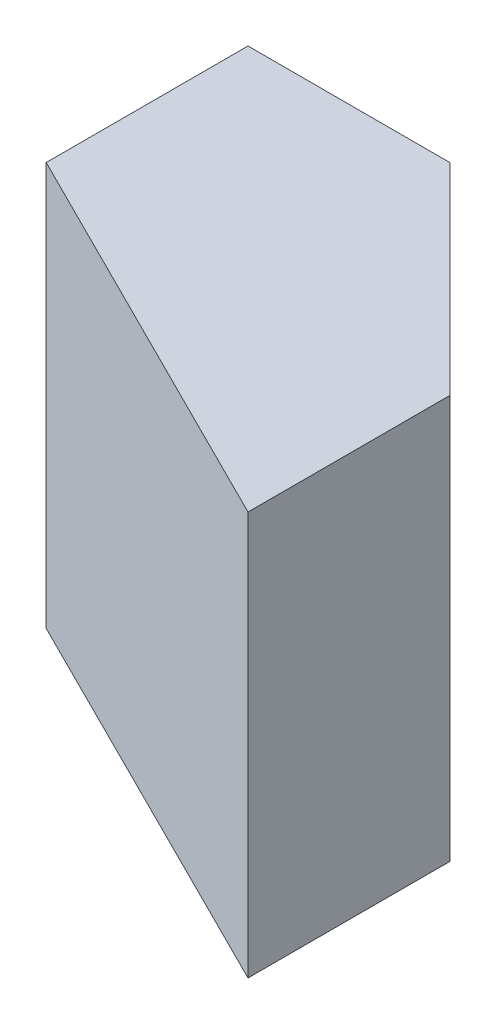
ISO-10303-21;
HEADER;
FILE_DESCRIPTION(('STEP AP214'),'2;1');
FILE_NAME('part.step','',(''),(''),'','','');
FILE_SCHEMA(('AUTOMOTIVE_DESIGN { 1 0 10303 214 1 1 1 1 }'));
ENDSEC;
DATA;
#1=APPLICATION_CONTEXT('core data for automotive mechanical design processes');
#2=APPLICATION_PROTOCOL_DEFINITION('international standard','automotive_design',2000,#1);
#3=PRODUCT_CONTEXT('',#1,'mechanical');
#4=PRODUCT('Part','Part','',(#3));
#5=PRODUCT_RELATED_PRODUCT_CATEGORY('part','',(#4));
#6=PRODUCT_DEFINITION_FORMATION('','',#4);
#7=PRODUCT_DEFINITION_CONTEXT('part definition',#1,'design');
#8=PRODUCT_DEFINITION('design','',#6,#7);
#9=PRODUCT_DEFINITION_SHAPE('','',#8);
#10=(LENGTH_UNIT() NAMED_UNIT(*) SI_UNIT(.MILLI.,.METRE.));
#11=(NAMED_UNIT(*) PLANE_ANGLE_UNIT() SI_UNIT($,.RADIAN.));
#12=(NAMED_UNIT(*) SI_UNIT($,.STERADIAN.) SOLID_ANGLE_UNIT());
#13=UNCERTAINTY_MEASURE_WITH_UNIT(LENGTH_MEASURE(1.E-05),#10,'distance_accuracy_value','');
#14=(GEOMETRIC_REPRESENTATION_CONTEXT(3) GLOBAL_UNCERTAINTY_ASSIGNED_CONTEXT((#13)) GLOBAL_UNIT_ASSIGNED_CONTEXT((#10,
#11,#12)) REPRESENTATION_CONTEXT('',''));
#15=CARTESIAN_POINT('',(0.,0.,0.));
#16=DIRECTION('',(0.,0.,1.));
#17=DIRECTION('',(1.,0.,0.));
#18=AXIS2_PLACEMENT_3D('',#15,#16,#17);
#19=CARTESIAN_POINT('',(0.,0.,20.));
#20=DIRECTION('',(1.,0.,0.));
#21=DIRECTION('',(0.,0.,-1.));
#22=AXIS2_PLACEMENT_3D('',#19,#20,#21);
#23=PLANE('',#22);
#24=DIRECTION('',(0.,0.,-1.));
#25=VECTOR('',#24,1.);
#26=CARTESIAN_POINT('',(0.,0.,20.));
#27=LINE('',#26,#25);
#28=CARTESIAN_POINT('',(0.,0.,10.));
#29=VERTEX_POINT('',#28);
#30=CARTESIAN_POINT('',(0.,0.,0.));
#31=VERTEX_POINT('',#30);
#32=EDGE_CURVE('E11',#29,#31,#27,.T.);
#33=ORIENTED_EDGE('',*,*,#32,.F.);
#34=DIRECTION('',(0.,1.,0.));
#35=VECTOR('',#34,1.);
#36=CARTESIAN_POINT('',(0.,0.,10.));
#37=LINE('',#36,#35);
#38=CARTESIAN_POINT('',(0.,20.,10.));
#39=VERTEX_POINT('',#38);
#40=EDGE_CURVE('E83',#29,#39,#37,.T.);
#41=ORIENTED_EDGE('',*,*,#40,.T.);
#42=DIRECTION('',(0.,0.,-1.));
#43=VECTOR('',#42,1.);
#44=CARTESIAN_POINT('',(0.,20.,20.));
#45=LINE('',#44,#43);
#46=CARTESIAN_POINT('',(0.,20.,0.));
#47=VERTEX_POINT('',#46);
#48=EDGE_CURVE('E97',#39,#47,#45,.T.);
#49=ORIENTED_EDGE('',*,*,#48,.T.);
#50=DIRECTION('',(0.,-1.,0.));
#51=VECTOR('',#50,1.);
#52=CARTESIAN_POINT('',(0.,0.,0.));
#53=LINE('',#52,#51);
#54=EDGE_CURVE('E120',#47,#31,#53,.T.);
#55=ORIENTED_EDGE('',*,*,#54,.T.);
#56=EDGE_LOOP('',(#33,#41,#49,#55));
#57=FACE_BOUND('',#56,.T.);
#58=ADVANCED_FACE('F33',(#57),#23,.F.);
#59=CARTESIAN_POINT('',(0.,0.,20.));
#60=DIRECTION('',(0.,1.,0.));
#61=DIRECTION('',(0.,0.,1.));
#62=AXIS2_PLACEMENT_3D('',#59,#60,#61);
#63=PLANE('',#62);
#64=DIRECTION('',(0.,0.,-1.));
#65=VECTOR('',#64,1.);
#66=CARTESIAN_POINT('',(20.,0.,20.));
#67=LINE('',#66,#65);
#68=CARTESIAN_POINT('',(20.,0.,20.));
#69=VERTEX_POINT('',#68);
#70=CARTESIAN_POINT('',(20.,0.,10.));
#71=VERTEX_POINT('',#70);
#72=EDGE_CURVE('E40',#69,#71,#67,.T.);
#73=ORIENTED_EDGE('',*,*,#72,.F.);
#74=DIRECTION('',(-0.894427190999916,0.,-0.447213595499958));
#75=VECTOR('',#74,1.);
#76=CARTESIAN_POINT('',(0.,0.,10.));
#77=LINE('',#76,#75);
#78=EDGE_CURVE('E56',#69,#29,#77,.T.);
#79=ORIENTED_EDGE('',*,*,#78,.T.);
#80=ORIENTED_EDGE('',*,*,#32,.T.);
#81=DIRECTION('',(1.,0.,0.));
#82=VECTOR('',#81,1.);
#83=CARTESIAN_POINT('',(0.,0.,0.));
#84=LINE('',#83,#82);
#85=CARTESIAN_POINT('',(10.,0.,0.));
#86=VERTEX_POINT('',#85);
#87=EDGE_CURVE('E115',#31,#86,#84,.T.);
#88=ORIENTED_EDGE('',*,*,#87,.T.);
#89=DIRECTION('',(0.707106781186548,0.,0.707106781186548));
#90=VECTOR('',#89,1.);
#91=CARTESIAN_POINT('',(10.,0.,0.));
#92=LINE('',#91,#90);
#93=EDGE_CURVE('E47',#86,#71,#92,.T.);
#94=ORIENTED_EDGE('',*,*,#93,.T.);
#95=EDGE_LOOP('',(#73,#79,#80,#88,#94));
#96=FACE_BOUND('',#95,.T.);
#97=ADVANCED_FACE('F114',(#96),#63,.F.);
#98=CARTESIAN_POINT('',(20.,0.,20.));
#99=DIRECTION('',(-1.,0.,0.));
#100=DIRECTION('',(0.,0.,1.));
#101=AXIS2_PLACEMENT_3D('',#98,#99,#100);
#102=PLANE('',#101);
#103=ORIENTED_EDGE('',*,*,#72,.T.);
#104=DIRECTION('',(0.,1.,0.));
#105=VECTOR('',#104,1.);
#106=CARTESIAN_POINT('',(20.,0.,10.));
#107=LINE('',#106,#105);
#108=CARTESIAN_POINT('',(20.,20.,10.));
#109=VERTEX_POINT('',#108);
#110=EDGE_CURVE('E72',#71,#109,#107,.T.);
#111=ORIENTED_EDGE('',*,*,#110,.T.);
#112=DIRECTION('',(0.,0.,-1.));
#113=VECTOR('',#112,1.);
#114=CARTESIAN_POINT('',(20.,20.,20.));
#115=LINE('',#114,#113);
#116=CARTESIAN_POINT('',(20.,20.,20.));
#117=VERTEX_POINT('',#116);
#118=EDGE_CURVE('E105',#117,#109,#115,.T.);
#119=ORIENTED_EDGE('',*,*,#118,.F.);
#120=DIRECTION('',(0.,1.,0.));
#121=VECTOR('',#120,1.);
#122=CARTESIAN_POINT('',(20.,0.,20.));
#123=LINE('',#122,#121);
#124=EDGE_CURVE('E89',#69,#117,#123,.T.);
#125=ORIENTED_EDGE('',*,*,#124,.F.);
#126=EDGE_LOOP('',(#103,#111,#119,#125));
#127=FACE_BOUND('',#126,.T.);
#128=ADVANCED_FACE('F113',(#127),#102,.F.);
#129=CARTESIAN_POINT('',(0.,20.,20.));
#130=DIRECTION('',(0.,-1.,0.));
#131=DIRECTION('',(0.,0.,-1.));
#132=AXIS2_PLACEMENT_3D('',#129,#130,#131);
#133=PLANE('',#132);
#134=ORIENTED_EDGE('',*,*,#48,.F.);
#135=DIRECTION('',(-0.894427190999916,0.,-0.447213595499958));
#136=VECTOR('',#135,1.);
#137=CARTESIAN_POINT('',(0.,20.,10.));
#138=LINE('',#137,#136);
#139=EDGE_CURVE('E86',#117,#39,#138,.T.);
#140=ORIENTED_EDGE('',*,*,#139,.F.);
#141=ORIENTED_EDGE('',*,*,#118,.T.);
#142=DIRECTION('',(0.707106781186548,0.,0.707106781186548));
#143=VECTOR('',#142,1.);
#144=CARTESIAN_POINT('',(10.,20.,0.));
#145=LINE('',#144,#143);
#146=CARTESIAN_POINT('',(10.,20.,0.));
#147=VERTEX_POINT('',#146);
#148=EDGE_CURVE('E99',#147,#109,#145,.T.);
#149=ORIENTED_EDGE('',*,*,#148,.F.);
#150=DIRECTION('',(-1.,0.,0.));
#151=VECTOR('',#150,1.);
#152=CARTESIAN_POINT('',(0.,20.,0.));
#153=LINE('',#152,#151);
#154=EDGE_CURVE('E103',#147,#47,#153,.T.);
#155=ORIENTED_EDGE('',*,*,#154,.T.);
#156=EDGE_LOOP('',(#134,#140,#141,#149,#155));
#157=FACE_BOUND('',#156,.T.);
#158=ADVANCED_FACE('F101',(#157),#133,.F.);
#159=CARTESIAN_POINT('',(0.,0.,0.));
#160=DIRECTION('',(0.,0.,-1.));
#161=DIRECTION('',(-1.,0.,0.));
#162=AXIS2_PLACEMENT_3D('',#159,#160,#161);
#163=PLANE('',#162);
#164=DIRECTION('',(0.,1.,0.));
#165=VECTOR('',#164,1.);
#166=CARTESIAN_POINT('',(10.,0.,0.));
#167=LINE('',#166,#165);
#168=EDGE_CURVE('E78',#86,#147,#167,.T.);
#169=ORIENTED_EDGE('',*,*,#168,.F.);
#170=ORIENTED_EDGE('',*,*,#87,.F.);
#171=ORIENTED_EDGE('',*,*,#54,.F.);
#172=ORIENTED_EDGE('',*,*,#154,.F.);
#173=EDGE_LOOP('',(#169,#170,#171,#172));
#174=FACE_BOUND('',#173,.T.);
#175=ADVANCED_FACE('F123',(#174),#163,.T.);
#176=CARTESIAN_POINT('',(10.,0.,0.));
#177=DIRECTION('',(-0.707106781186548,0.,0.707106781186548));
#178=DIRECTION('',(0.707106781186548,0.,0.707106781186548));
#179=AXIS2_PLACEMENT_3D('',#176,#177,#178);
#180=PLANE('',#179);
#181=ORIENTED_EDGE('',*,*,#148,.T.);
#182=ORIENTED_EDGE('',*,*,#110,.F.);
#183=ORIENTED_EDGE('',*,*,#93,.F.);
#184=ORIENTED_EDGE('',*,*,#168,.T.);
#185=EDGE_LOOP('',(#181,#182,#183,#184));
#186=FACE_BOUND('',#185,.T.);
#187=ADVANCED_FACE('F125',(#186),#180,.F.);
#188=CARTESIAN_POINT('',(0.,0.,10.));
#189=DIRECTION('',(0.447213595499958,0.,-0.894427190999916));
#190=DIRECTION('',(-0.894427190999916,0.,-0.447213595499958));
#191=AXIS2_PLACEMENT_3D('',#188,#189,#190);
#192=PLANE('',#191);
#193=ORIENTED_EDGE('',*,*,#139,.T.);
#194=ORIENTED_EDGE('',*,*,#40,.F.);
#195=ORIENTED_EDGE('',*,*,#78,.F.);
#196=ORIENTED_EDGE('',*,*,#124,.T.);
#197=EDGE_LOOP('',(#193,#194,#195,#196));
#198=FACE_BOUND('',#197,.T.);
#199=ADVANCED_FACE('F87',(#198),#192,.F.);
#200=CLOSED_SHELL('',(#58,#97,#128,#158,#175,#187,#199));
#201=MANIFOLD_SOLID_BREP('B2',#200);
#202=ADVANCED_BREP_SHAPE_REPRESENTATION('',(#18,#201),#14);
#203=SHAPE_DEFINITION_REPRESENTATION(#9,#202);
ENDSEC;
END-ISO-10303-21;
